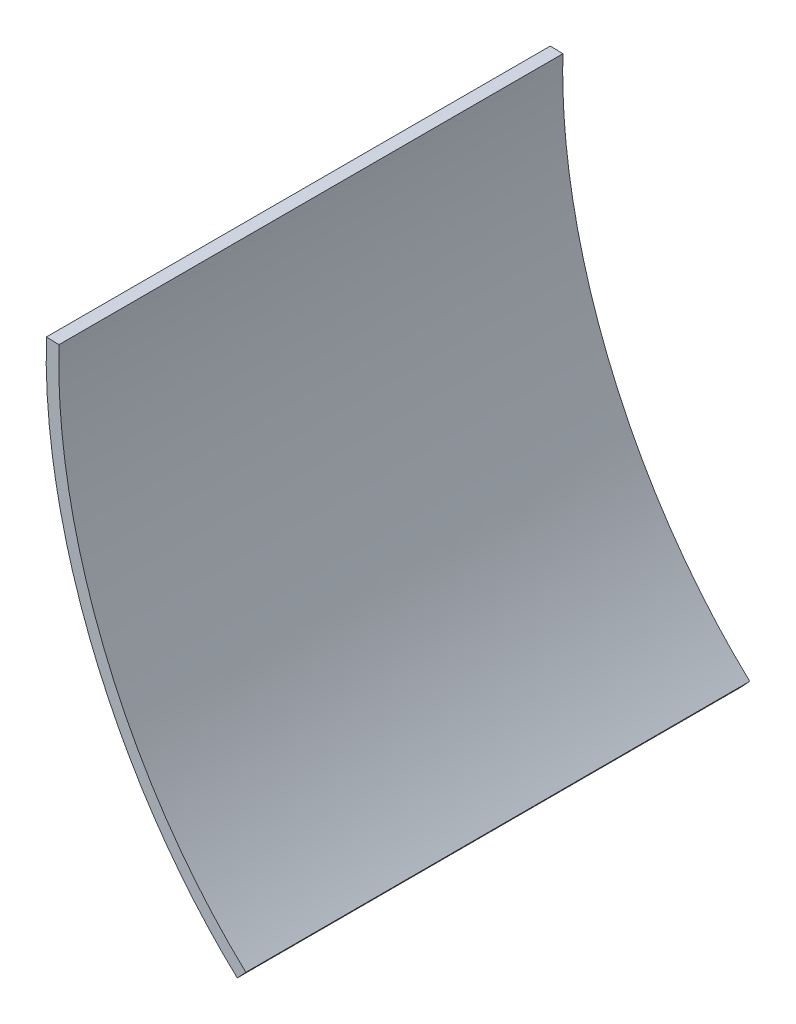
ISO-10303-21;
HEADER;
FILE_DESCRIPTION(('STEP AP214'),'2;1');
FILE_NAME('part.step','',(''),(''),'','','');
FILE_SCHEMA(('AUTOMOTIVE_DESIGN { 1 0 10303 214 1 1 1 1 }'));
ENDSEC;
DATA;
#1=APPLICATION_CONTEXT('core data for automotive mechanical design processes');
#2=APPLICATION_PROTOCOL_DEFINITION('international standard','automotive_design',2000,#1);
#3=PRODUCT_CONTEXT('',#1,'mechanical');
#4=PRODUCT('Part','Part','',(#3));
#5=PRODUCT_RELATED_PRODUCT_CATEGORY('part','',(#4));
#6=PRODUCT_DEFINITION_FORMATION('','',#4);
#7=PRODUCT_DEFINITION_CONTEXT('part definition',#1,'design');
#8=PRODUCT_DEFINITION('design','',#6,#7);
#9=PRODUCT_DEFINITION_SHAPE('','',#8);
#10=(LENGTH_UNIT() NAMED_UNIT(*) SI_UNIT(.MILLI.,.METRE.));
#11=(NAMED_UNIT(*) PLANE_ANGLE_UNIT() SI_UNIT($,.RADIAN.));
#12=(NAMED_UNIT(*) SI_UNIT($,.STERADIAN.) SOLID_ANGLE_UNIT());
#13=UNCERTAINTY_MEASURE_WITH_UNIT(LENGTH_MEASURE(1.E-05),#10,'distance_accuracy_value','');
#14=(GEOMETRIC_REPRESENTATION_CONTEXT(3) GLOBAL_UNCERTAINTY_ASSIGNED_CONTEXT((#13)) GLOBAL_UNIT_ASSIGNED_CONTEXT((#10,
#11,#12)) REPRESENTATION_CONTEXT('',''));
#15=CARTESIAN_POINT('',(0.,0.,0.));
#16=DIRECTION('',(0.,0.,1.));
#17=DIRECTION('',(1.,0.,0.));
#18=AXIS2_PLACEMENT_3D('',#15,#16,#17);
#19=CARTESIAN_POINT('',(100.277127399247,-130.340132390831,-101.6));
#20=CARTESIAN_POINT('',(76.0999680147705,-107.898756151345,-101.6));
#21=CARTESIAN_POINT('',(61.6308285270147,-72.5712036370278,-101.6));
#22=CARTESIAN_POINT('',(62.6057664741343,-39.5909899515031,-101.6));
#23=B_SPLINE_CURVE_WITH_KNOTS('',3,(#19,#20,#21,#22),.UNSPECIFIED.,.F.,.F.,(4,4),(0.,1.),.UNSPECIFIED.);
#24=DIRECTION('',(0.,0.,1.));
#25=VECTOR('',#24,1.);
#26=SURFACE_OF_LINEAR_EXTRUSION('',#23,#25);
#27=CARTESIAN_POINT('',(100.277127399247,-130.340132390831,0.));
#28=CARTESIAN_POINT('',(76.0999680147705,-107.898756151345,0.));
#29=CARTESIAN_POINT('',(61.6308285270147,-72.5712036370278,0.));
#30=CARTESIAN_POINT('',(62.6057664741343,-39.5909899515031,0.));
#31=B_SPLINE_CURVE_WITH_KNOTS('',3,(#27,#28,#29,#30),.UNSPECIFIED.,.F.,.F.,(4,4),(0.,1.),.UNSPECIFIED.);
#32=CARTESIAN_POINT('',(100.277127399247,-130.340132390831,0.));
#33=VERTEX_POINT('',#32);
#34=CARTESIAN_POINT('',(62.6057664741343,-39.5909899515031,0.));
#35=VERTEX_POINT('',#34);
#36=EDGE_CURVE('E123',#33,#35,#31,.T.);
#37=ORIENTED_EDGE('',*,*,#36,.F.);
#38=DIRECTION('',(0.,0.,1.));
#39=VECTOR('',#38,1.);
#40=CARTESIAN_POINT('',(100.277127399247,-130.340132390831,-101.6));
#41=LINE('',#40,#39);
#42=CARTESIAN_POINT('',(100.277127399247,-130.340132390831,-101.6));
#43=VERTEX_POINT('',#42);
#44=EDGE_CURVE('E11',#43,#33,#41,.T.);
#45=ORIENTED_EDGE('',*,*,#44,.F.);
#46=CARTESIAN_POINT('',(62.6057664741343,-39.5909899515031,-101.6));
#47=VERTEX_POINT('',#46);
#48=EDGE_CURVE('E93',#43,#47,#23,.T.);
#49=ORIENTED_EDGE('',*,*,#48,.T.);
#50=DIRECTION('',(0.,0.,1.));
#51=VECTOR('',#50,1.);
#52=CARTESIAN_POINT('',(62.6057664741343,-39.5909899515031,-101.6));
#53=LINE('',#52,#51);
#54=EDGE_CURVE('E38',#47,#35,#53,.T.);
#55=ORIENTED_EDGE('',*,*,#54,.T.);
#56=EDGE_LOOP('',(#37,#45,#49,#55));
#57=FACE_BOUND('',#56,.T.);
#58=ADVANCED_FACE('F34',(#57),#26,.T.);
#59=CARTESIAN_POINT('',(98.5491472866568,-132.201767352495,-101.6));
#60=DIRECTION('',(0.732927150261725,-0.680307130941038,0.));
#61=DIRECTION('',(0.680307130941038,0.732927150261725,0.));
#62=AXIS2_PLACEMENT_3D('',#59,#60,#61);
#63=PLANE('',#62);
#64=DIRECTION('',(0.680307130941038,0.732927150261725,0.));
#65=VECTOR('',#64,1.);
#66=CARTESIAN_POINT('',(98.5491472866568,-132.201767352495,0.));
#67=LINE('',#66,#65);
#68=CARTESIAN_POINT('',(98.5491472866568,-132.201767352495,0.));
#69=VERTEX_POINT('',#68);
#70=EDGE_CURVE('E95',#69,#33,#67,.T.);
#71=ORIENTED_EDGE('',*,*,#70,.F.);
#72=DIRECTION('',(0.,0.,1.));
#73=VECTOR('',#72,1.);
#74=CARTESIAN_POINT('',(98.5491472866568,-132.201767352495,-101.6));
#75=LINE('',#74,#73);
#76=CARTESIAN_POINT('',(98.5491472866568,-132.201767352495,-101.6));
#77=VERTEX_POINT('',#76);
#78=EDGE_CURVE('E44',#77,#69,#75,.T.);
#79=ORIENTED_EDGE('',*,*,#78,.F.);
#80=DIRECTION('',(0.680307130941038,0.732927150261725,0.));
#81=VECTOR('',#80,1.);
#82=CARTESIAN_POINT('',(98.5491472866568,-132.201767352495,-101.6));
#83=LINE('',#82,#81);
#84=EDGE_CURVE('E90',#77,#43,#83,.T.);
#85=ORIENTED_EDGE('',*,*,#84,.T.);
#86=ORIENTED_EDGE('',*,*,#44,.T.);
#87=EDGE_LOOP('',(#71,#79,#85,#86));
#88=FACE_BOUND('',#87,.T.);
#89=ADVANCED_FACE('F110',(#88),#63,.T.);
#90=CARTESIAN_POINT('',(60.0668755626693,-39.5159370389663,-101.6));
#91=CARTESIAN_POINT('',(60.0042923974618,-41.6330011739267,-101.6));
#92=CARTESIAN_POINT('',(60.0033757730972,-45.8625966578404,-101.6));
#93=CARTESIAN_POINT('',(60.4829553200021,-54.3802385891714,-101.6));
#94=CARTESIAN_POINT('',(61.9634701936101,-65.0331672652128,-101.6));
#95=CARTESIAN_POINT('',(65.0780026038032,-77.666809047349,-101.6));
#96=CARTESIAN_POINT('',(69.4616167887513,-89.9718914304955,-101.6));
#97=CARTESIAN_POINT('',(75.0488255688175,-101.775636026498,-101.6));
#98=CARTESIAN_POINT('',(81.7716114337944,-112.898614813215,-101.6));
#99=CARTESIAN_POINT('',(89.5810333693989,-123.176238055719,-101.6));
#100=CARTESIAN_POINT('',(95.4371300175236,-129.313175302048,-101.6));
#101=CARTESIAN_POINT('',(98.5491472866568,-132.201767352495,-101.6));
#102=B_SPLINE_CURVE_WITH_KNOTS('',3,(#90,#91,#92,#93,#94,#95,#96,#97,#98,#99,#100,#101),
.UNSPECIFIED.,.F.,.F.,(4,1,1,1,1,1,1,1,1,4),(0.,0.0625,0.125,0.25,0.375,0.5,0.625,0.75,0.875,
1.),.UNSPECIFIED.);
#103=DIRECTION('',(0.,0.,1.));
#104=VECTOR('',#103,1.);
#105=SURFACE_OF_LINEAR_EXTRUSION('',#102,#104);
#106=CARTESIAN_POINT('',(60.0668755626693,-39.5159370389663,0.));
#107=CARTESIAN_POINT('',(60.0042923974618,-41.6330011739267,0.));
#108=CARTESIAN_POINT('',(60.0033757730972,-45.8625966578404,0.));
#109=CARTESIAN_POINT('',(60.4829553200021,-54.3802385891714,0.));
#110=CARTESIAN_POINT('',(61.9634701936101,-65.0331672652128,0.));
#111=CARTESIAN_POINT('',(65.0780026038032,-77.666809047349,0.));
#112=CARTESIAN_POINT('',(69.4616167887513,-89.9718914304955,0.));
#113=CARTESIAN_POINT('',(75.0488255688175,-101.775636026498,0.));
#114=CARTESIAN_POINT('',(81.7716114337944,-112.898614813215,0.));
#115=CARTESIAN_POINT('',(89.5810333693989,-123.176238055719,0.));
#116=CARTESIAN_POINT('',(95.4371300175236,-129.313175302048,0.));
#117=CARTESIAN_POINT('',(98.5491472866568,-132.201767352495,0.));
#118=B_SPLINE_CURVE_WITH_KNOTS('',3,(#106,#107,#108,#109,#110,#111,#112,#113,#114,#115,#116,
#117),.UNSPECIFIED.,.F.,.F.,(4,1,1,1,1,1,1,1,1,4),(0.,0.0625,0.125,0.25,0.375,0.5,0.625,0.75,
0.875,1.),.UNSPECIFIED.);
#119=CARTESIAN_POINT('',(60.0668755626693,-39.5159370389663,0.));
#120=VERTEX_POINT('',#119);
#121=EDGE_CURVE('E85',#120,#69,#118,.T.);
#122=ORIENTED_EDGE('',*,*,#121,.F.);
#123=DIRECTION('',(0.,0.,1.));
#124=VECTOR('',#123,1.);
#125=CARTESIAN_POINT('',(60.0668755626693,-39.5159370389663,-101.6));
#126=LINE('',#125,#124);
#127=CARTESIAN_POINT('',(60.0668755626693,-39.5159370389663,-101.6));
#128=VERTEX_POINT('',#127);
#129=EDGE_CURVE('E80',#128,#120,#126,.T.);
#130=ORIENTED_EDGE('',*,*,#129,.F.);
#131=EDGE_CURVE('E83',#128,#77,#102,.T.);
#132=ORIENTED_EDGE('',*,*,#131,.T.);
#133=ORIENTED_EDGE('',*,*,#78,.T.);
#134=EDGE_LOOP('',(#122,#130,#132,#133));
#135=FACE_BOUND('',#134,.T.);
#136=ADVANCED_FACE('F82',(#135),#105,.T.);
#137=CARTESIAN_POINT('',(60.0668755626693,-39.5159370389663,-101.6));
#138=DIRECTION('',(0.0295483907625178,0.999563350970485,0.));
#139=DIRECTION('',(-0.999563350970485,0.0295483907625178,0.));
#140=AXIS2_PLACEMENT_3D('',#137,#138,#139);
#141=PLANE('',#140);
#142=DIRECTION('',(-0.999563350970485,0.0295483907625178,0.));
#143=VECTOR('',#142,1.);
#144=CARTESIAN_POINT('',(60.0668755626693,-39.5159370389663,0.));
#145=LINE('',#144,#143);
#146=EDGE_CURVE('E126',#35,#120,#145,.T.);
#147=ORIENTED_EDGE('',*,*,#146,.F.);
#148=ORIENTED_EDGE('',*,*,#54,.F.);
#149=DIRECTION('',(-0.999563350970485,0.0295483907625178,0.));
#150=VECTOR('',#149,1.);
#151=CARTESIAN_POINT('',(60.0668755626693,-39.5159370389663,-101.6));
#152=LINE('',#151,#150);
#153=EDGE_CURVE('E89',#47,#128,#152,.T.);
#154=ORIENTED_EDGE('',*,*,#153,.T.);
#155=ORIENTED_EDGE('',*,*,#129,.T.);
#156=EDGE_LOOP('',(#147,#148,#154,#155));
#157=FACE_BOUND('',#156,.T.);
#158=ADVANCED_FACE('F92',(#157),#141,.T.);
#159=CARTESIAN_POINT('',(72.0094104373421,-88.9176252134314,-101.6));
#160=DIRECTION('',(0.,0.,1.));
#161=DIRECTION('',(1.,0.,0.));
#162=AXIS2_PLACEMENT_3D('',#159,#160,#161);
#163=PLANE('',#162);
#164=ORIENTED_EDGE('',*,*,#48,.F.);
#165=ORIENTED_EDGE('',*,*,#84,.F.);
#166=ORIENTED_EDGE('',*,*,#131,.F.);
#167=ORIENTED_EDGE('',*,*,#153,.F.);
#168=EDGE_LOOP('',(#164,#165,#166,#167));
#169=FACE_BOUND('',#168,.T.);
#170=ADVANCED_FACE('F88',(#169),#163,.F.);
#171=CARTESIAN_POINT('',(72.0094104373421,-88.9176252134314,0.));
#172=DIRECTION('',(0.,0.,1.));
#173=DIRECTION('',(1.,0.,0.));
#174=AXIS2_PLACEMENT_3D('',#171,#172,#173);
#175=PLANE('',#174);
#176=ORIENTED_EDGE('',*,*,#36,.T.);
#177=ORIENTED_EDGE('',*,*,#146,.T.);
#178=ORIENTED_EDGE('',*,*,#121,.T.);
#179=ORIENTED_EDGE('',*,*,#70,.T.);
#180=EDGE_LOOP('',(#176,#177,#178,#179));
#181=FACE_BOUND('',#180,.T.);
#182=ADVANCED_FACE('F116',(#181),#175,.T.);
#183=CLOSED_SHELL('',(#58,#89,#136,#158,#170,#182));
#184=MANIFOLD_SOLID_BREP('B2',#183);
#185=ADVANCED_BREP_SHAPE_REPRESENTATION('',(#18,#184),#14);
#186=SHAPE_DEFINITION_REPRESENTATION(#9,#185);
ENDSEC;
END-ISO-10303-21;
